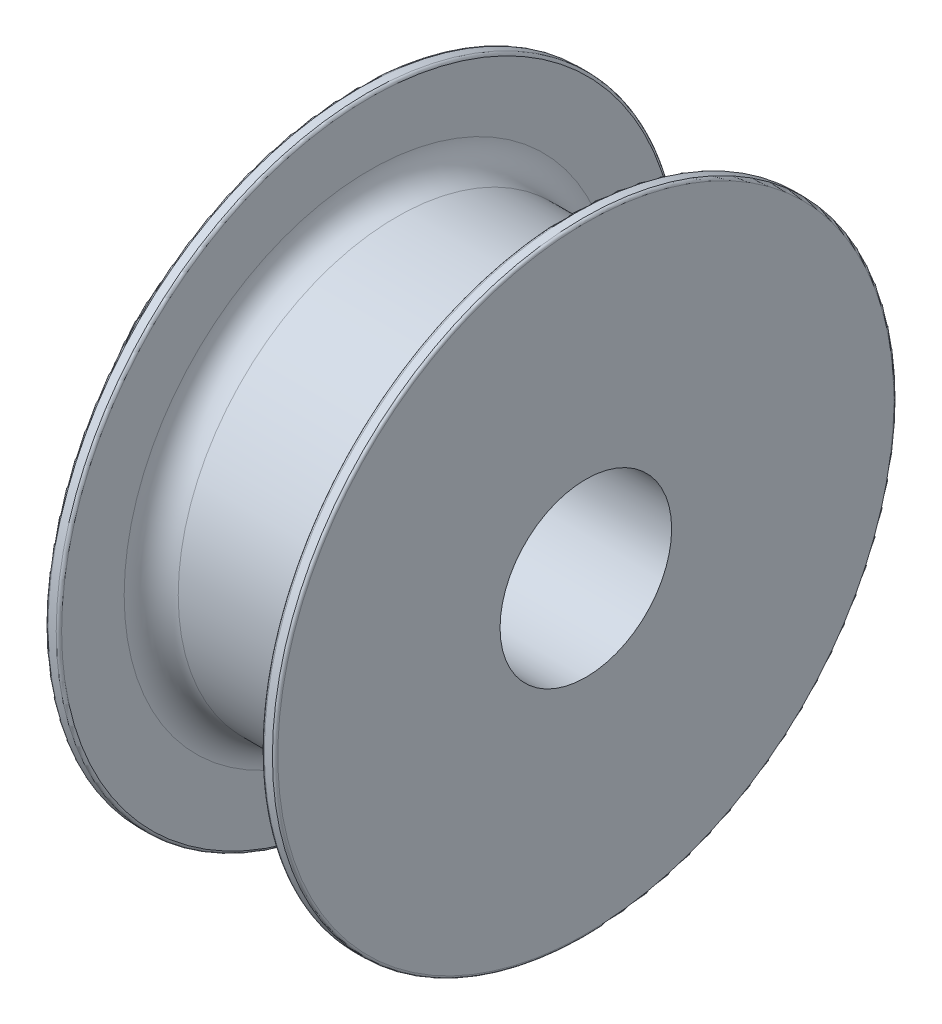
ISO-10303-21;
HEADER;
FILE_DESCRIPTION(('STEP AP214'),'2;1');
FILE_NAME('part.step','',(''),(''),'','','');
FILE_SCHEMA(('AUTOMOTIVE_DESIGN { 1 0 10303 214 1 1 1 1 }'));
ENDSEC;
DATA;
#1=APPLICATION_CONTEXT('core data for automotive mechanical design processes');
#2=APPLICATION_PROTOCOL_DEFINITION('international standard','automotive_design',2000,#1);
#3=PRODUCT_CONTEXT('',#1,'mechanical');
#4=PRODUCT('Part','Part','',(#3));
#5=PRODUCT_RELATED_PRODUCT_CATEGORY('part','',(#4));
#6=PRODUCT_DEFINITION_FORMATION('','',#4);
#7=PRODUCT_DEFINITION_CONTEXT('part definition',#1,'design');
#8=PRODUCT_DEFINITION('design','',#6,#7);
#9=PRODUCT_DEFINITION_SHAPE('','',#8);
#10=(LENGTH_UNIT() NAMED_UNIT(*) SI_UNIT(.MILLI.,.METRE.));
#11=(NAMED_UNIT(*) PLANE_ANGLE_UNIT() SI_UNIT($,.RADIAN.));
#12=(NAMED_UNIT(*) SI_UNIT($,.STERADIAN.) SOLID_ANGLE_UNIT());
#13=UNCERTAINTY_MEASURE_WITH_UNIT(LENGTH_MEASURE(1.E-05),#10,'distance_accuracy_value','');
#14=(GEOMETRIC_REPRESENTATION_CONTEXT(3) GLOBAL_UNCERTAINTY_ASSIGNED_CONTEXT((#13)) GLOBAL_UNIT_ASSIGNED_CONTEXT((#10,
#11,#12)) REPRESENTATION_CONTEXT('',''));
#15=CARTESIAN_POINT('',(0.,0.,0.));
#16=DIRECTION('',(0.,0.,1.));
#17=DIRECTION('',(1.,0.,0.));
#18=AXIS2_PLACEMENT_3D('',#15,#16,#17);
#19=CARTESIAN_POINT('',(-1.,0.,0.));
#20=DIRECTION('',(-1.,0.,0.));
#21=DIRECTION('',(0.,0.,1.));
#22=AXIS2_PLACEMENT_3D('',#19,#20,#21);
#23=PLANE('',#22);
#24=CARTESIAN_POINT('',(-1.,0.,0.));
#25=DIRECTION('',(-1.,0.,0.));
#26=DIRECTION('',(0.,0.,1.));
#27=AXIS2_PLACEMENT_3D('',#24,#25,#26);
#28=CIRCLE('',#27,22.8);
#29=CARTESIAN_POINT('',(-1.,0.,22.8));
#30=VERTEX_POINT('',#29);
#31=EDGE_CURVE('E158',#30,#30,#28,.T.);
#32=ORIENTED_EDGE('',*,*,#31,.T.);
#33=EDGE_LOOP('',(#32));
#34=FACE_BOUND('',#33,.T.);
#35=CARTESIAN_POINT('',(-1.,0.,0.));
#36=DIRECTION('',(-1.,0.,0.));
#37=DIRECTION('',(0.,0.,1.));
#38=AXIS2_PLACEMENT_3D('',#35,#36,#37);
#39=CIRCLE('',#38,12.5);
#40=CARTESIAN_POINT('',(-1.,0.,12.5));
#41=VERTEX_POINT('',#40);
#42=EDGE_CURVE('E179',#41,#41,#39,.T.);
#43=ORIENTED_EDGE('',*,*,#42,.F.);
#44=EDGE_LOOP('',(#43));
#45=FACE_BOUND('',#44,.T.);
#46=ADVANCED_FACE('F31',(#34,#45),#23,.T.);
#47=CARTESIAN_POINT('',(15.,0.,0.));
#48=DIRECTION('',(-1.,0.,0.));
#49=DIRECTION('',(0.,0.,1.));
#50=AXIS2_PLACEMENT_3D('',#47,#48,#49);
#51=CYLINDRICAL_SURFACE('',#50,16.1701558764829);
#52=CARTESIAN_POINT('',(2.,0.,0.));
#53=DIRECTION('',(-1.,0.,0.));
#54=DIRECTION('',(0.,0.,1.));
#55=AXIS2_PLACEMENT_3D('',#52,#53,#54);
#56=CIRCLE('',#55,16.1701558764829);
#57=CARTESIAN_POINT('',(2.,0.,16.1701558764829));
#58=VERTEX_POINT('',#57);
#59=EDGE_CURVE('E143',#58,#58,#56,.F.);
#60=ORIENTED_EDGE('',*,*,#59,.T.);
#61=EDGE_LOOP('',(#60));
#62=FACE_BOUND('',#61,.T.);
#63=CARTESIAN_POINT('',(13.,0.,0.));
#64=DIRECTION('',(1.,0.,0.));
#65=DIRECTION('',(0.,0.,-1.));
#66=AXIS2_PLACEMENT_3D('',#63,#64,#65);
#67=CIRCLE('',#66,16.1701558764829);
#68=CARTESIAN_POINT('',(13.,0.,-16.1701558764829));
#69=VERTEX_POINT('',#68);
#70=EDGE_CURVE('E149',#69,#69,#67,.F.);
#71=ORIENTED_EDGE('',*,*,#70,.T.);
#72=EDGE_LOOP('',(#71));
#73=FACE_BOUND('',#72,.T.);
#74=ADVANCED_FACE('F81',(#62,#73),#51,.T.);
#75=CARTESIAN_POINT('',(15.,0.,0.));
#76=DIRECTION('',(-1.,0.,0.));
#77=DIRECTION('',(0.,0.,1.));
#78=AXIS2_PLACEMENT_3D('',#75,#76,#77);
#79=CYLINDRICAL_SURFACE('',#78,6.35);
#80=CARTESIAN_POINT('',(-1.25733825878287,0.,-6.35));
#81=CARTESIAN_POINT('',(-1.2573391465005,0.0834969220594999,-6.34999931166444));
#82=CARTESIAN_POINT('',(-1.26063813322883,0.167002655580042,-6.34834758911701));
#83=CARTESIAN_POINT('',(-1.27378413333277,0.333378330258781,-6.34179105821715));
#84=CARTESIAN_POINT('',(-1.28363399530864,0.416247978955771,-6.33688483467113));
#85=CARTESIAN_POINT('',(-1.32291032382889,0.66318203064701,-6.31742426748325));
#86=CARTESIAN_POINT('',(-1.36206333618427,0.825450146761554,-6.29812827299425));
#87=CARTESIAN_POINT('',(-1.46432897007702,1.13965128900426,-6.2489182313574));
#88=CARTESIAN_POINT('',(-1.52734847802628,1.29162180811869,-6.21904547786825));
#89=CARTESIAN_POINT('',(-1.67507433241177,1.58264035037879,-6.15142812041637));
#90=CARTESIAN_POINT('',(-1.75977896893383,1.72168939123018,-6.11368413715877));
#91=CARTESIAN_POINT('',(-1.95430788851709,1.99234108848171,-6.03111096182982));
#92=CARTESIAN_POINT('',(-2.0653418365768,2.12298433900091,-5.98599127270818));
#93=CARTESIAN_POINT('',(-2.30673494235566,2.36467069069853,-5.89470535591056));
#94=CARTESIAN_POINT('',(-2.43710868854931,2.47569885601321,-5.84853836069043));
#95=CARTESIAN_POINT('',(-2.72575920653619,2.68368848497886,-5.75623634934464));
#96=CARTESIAN_POINT('',(-2.88541579008446,2.77889135161934,-5.71038146176788));
#97=CARTESIAN_POINT('',(-3.1368862459573,2.90019349951534,-5.64919759286363));
#98=CARTESIAN_POINT('',(-3.22273832061155,2.93705266116892,-5.63006420805933));
#99=CARTESIAN_POINT('',(-3.39792387248929,3.00322508739606,-5.59504604853267));
#100=CARTESIAN_POINT('',(-3.48725525696343,3.03254280972159,-5.57915935583429));
#101=CARTESIAN_POINT('',(-3.66334881074762,3.08174263292982,-5.55212611635049));
#102=CARTESIAN_POINT('',(-3.74994905281144,3.10208128111978,-5.54075429137746));
#103=CARTESIAN_POINT('',(-3.92492553777727,3.13545600360765,-5.52193654886444));
#104=CARTESIAN_POINT('',(-4.01330081255457,3.14849595237257,-5.51448854851135));
#105=CARTESIAN_POINT('',(-4.19104499763149,3.1670771305344,-5.50383875782919));
#106=CARTESIAN_POINT('',(-4.28041327677027,3.1726228759965,-5.50063441026522));
#107=CARTESIAN_POINT('',(-4.45931904296096,3.17614778806993,-5.49859788398609));
#108=CARTESIAN_POINT('',(-4.54885651305421,3.17412767659872,-5.49976528812799));
#109=CARTESIAN_POINT('',(-4.79508613450728,3.1581193033026,-5.50899190362732));
#110=CARTESIAN_POINT('',(-4.95117998859624,3.13621253452965,-5.52160857357707));
#111=CARTESIAN_POINT('',(-5.2569849000894,3.07003746372168,-5.55866493052824));
#112=CARTESIAN_POINT('',(-5.40669390780564,3.02576203854504,-5.58310838358077));
#113=CARTESIAN_POINT('',(-5.69988255534701,2.91531509833647,-5.64157885407236));
#114=CARTESIAN_POINT('',(-5.8431358687195,2.84865758129418,-5.67581583876129));
#115=CARTESIAN_POINT('',(-6.11710434495689,2.69570761526054,-5.75003268807633));
#116=CARTESIAN_POINT('',(-6.24781383839138,2.60940634674629,-5.79001512927804));
#117=CARTESIAN_POINT('',(-6.51044253303317,2.40685964249565,-5.87734289018611));
#118=CARTESIAN_POINT('',(-6.64041364363938,2.28820488335253,-5.92497898403936));
#119=CARTESIAN_POINT('',(-6.87942340164671,2.03058898448427,-6.01813700574905));
#120=CARTESIAN_POINT('',(-6.98845204514157,1.89161819563546,-6.06365791538158));
#121=CARTESIAN_POINT('',(-7.18724017850259,1.58913989972483,-6.1500381059768));
#122=CARTESIAN_POINT('',(-7.27586974436281,1.42479265164789,-6.19058274974572));
#123=CARTESIAN_POINT('',(-7.42349634041822,1.08098023585583,-6.25976272299952));
#124=CARTESIAN_POINT('',(-7.48251689991458,0.901527205073897,-6.28840750578946));
#125=CARTESIAN_POINT('',(-7.56439766218192,0.548533610626834,-6.32854759690358));
#126=CARTESIAN_POINT('',(-7.58984793137021,0.375734359385245,-6.34126679122995));
#127=CARTESIAN_POINT('',(-7.61198878104313,0.0278752299448318,-6.35231817716325));
#128=CARTESIAN_POINT('',(-7.6086929859222,-0.147183538060018,-6.35065718436129));
#129=CARTESIAN_POINT('',(-7.57493202283749,-0.480164686080361,-6.33384535408399));
#130=CARTESIAN_POINT('',(-7.54659246730803,-0.638363620564189,-6.31975005060431));
#131=CARTESIAN_POINT('',(-7.46688238057298,-0.947441883053,-6.28085393924121));
#132=CARTESIAN_POINT('',(-7.41550931030559,-1.09832040207141,-6.25605195113515));
#133=CARTESIAN_POINT('',(-7.28984312784507,-1.39347133182512,-6.19709998236334));
#134=CARTESIAN_POINT('',(-7.21493667467168,-1.53743151047822,-6.16270299610717));
#135=CARTESIAN_POINT('',(-7.045021833097,-1.8112148234104,-6.08787118465664));
#136=CARTESIAN_POINT('',(-6.95000488139747,-1.94103189959927,-6.0474337895468));
#137=CARTESIAN_POINT('',(-6.7317989084091,-2.19636241342679,-5.95973602709939));
#138=CARTESIAN_POINT('',(-6.60675965167131,-2.3202013468198,-5.91219559251098));
#139=CARTESIAN_POINT('',(-6.33757590363312,-2.54589381918874,-5.81858093231368));
#140=CARTESIAN_POINT('',(-6.19341830640194,-2.6477321493525,-5.77250773963547));
#141=CARTESIAN_POINT('',(-5.88126965682452,-2.83117262876716,-5.68487535288742));
#142=CARTESIAN_POINT('',(-5.71246248927249,-2.91155594998014,-5.64364281441821));
#143=CARTESIAN_POINT('',(-5.3609937938932,-3.04191297152938,-5.5744767953732));
#144=CARTESIAN_POINT('',(-5.17835046093549,-3.0919258549222,-5.54652618900869));
#145=CARTESIAN_POINT('',(-4.82314830231271,-3.15551086037918,-5.51057765714603));
#146=CARTESIAN_POINT('',(-4.65130450837566,-3.17212027309711,-5.50092192343245));
#147=CARTESIAN_POINT('',(-4.30709381628767,-3.17718805563876,-5.49800001145358));
#148=CARTESIAN_POINT('',(-4.13472717724023,-3.16565862768386,-5.5047267290444));
#149=CARTESIAN_POINT('',(-3.81167815570896,-3.11761548073658,-5.53205211477784));
#150=CARTESIAN_POINT('',(-3.66049431705172,-3.08358651207686,-5.55126823076269));
#151=CARTESIAN_POINT('',(-3.3661474286157,-2.99458164828807,-5.59977978302582));
#152=CARTESIAN_POINT('',(-3.22298697593257,-2.93959901505999,-5.62907846127335));
#153=CARTESIAN_POINT('',(-2.93810455935433,-2.8061154442137,-5.69685576337174));
#154=CARTESIAN_POINT('',(-2.7971254494172,-2.72628260503929,-5.73581889480533));
#155=CARTESIAN_POINT('',(-2.52964082705977,-2.54682759156583,-5.81772207082382));
#156=CARTESIAN_POINT('',(-2.40314289884016,-2.44719512169931,-5.8606641782013));
#157=CARTESIAN_POINT('',(-2.15224073460581,-2.21680287661219,-5.95192753761203));
#158=CARTESIAN_POINT('',(-2.02995850237008,-2.08373188558712,-6.00026839877346));
#159=CARTESIAN_POINT('',(-1.80894038554976,-1.79751265125244,-6.0921234557675));
#160=CARTESIAN_POINT('',(-1.71021719280015,-1.64435365457428,-6.13563504323042));
#161=CARTESIAN_POINT('',(-1.5820579925858,-1.40178715704487,-6.19391073190243));
#162=CARTESIAN_POINT('',(-1.54253767510148,-1.31842200030919,-6.21223173271383));
#163=CARTESIAN_POINT('',(-1.47073878395917,-1.1480770102167,-6.24595363475604));
#164=CARTESIAN_POINT('',(-1.4384566522485,-1.06109897786306,-6.26135597012704));
#165=CARTESIAN_POINT('',(-1.38157891286787,-0.884361322813108,-6.28875097111981));
#166=CARTESIAN_POINT('',(-1.35696654064476,-0.794608244970572,-6.30075106809478));
#167=CARTESIAN_POINT('',(-1.31567086925298,-0.612925661591582,-6.32100983571903));
#168=CARTESIAN_POINT('',(-1.29898272658933,-0.520997521680291,-6.3292707916836));
#169=CARTESIAN_POINT('',(-1.27672197392048,-0.357531347524375,-6.34032503263334));
#170=CARTESIAN_POINT('',(-1.26945943753324,-0.286274046488597,-6.34394670812889));
#171=CARTESIAN_POINT('',(-1.2597671322453,-0.143346668941348,-6.34878452045567));
#172=CARTESIAN_POINT('',(-1.25733749673604,-0.0716765810914262,-6.35000059089052));
#173=CARTESIAN_POINT('',(-1.25733825878287,0.,-6.35));
#174=B_SPLINE_CURVE_WITH_KNOTS('',3,(#80,#81,#82,#83,#84,#85,#86,#87,#88,#89,#90,#91,#92,#93,
#94,#95,#96,#97,#98,#99,#100,#101,#102,#103,#104,#105,#106,#107,#108,#109,#110,#111,#112,#113,
#114,#115,#116,#117,#118,#119,#120,#121,#122,#123,#124,#125,#126,#127,#128,#129,#130,#131,#132,
#133,#134,#135,#136,#137,#138,#139,#140,#141,#142,#143,#144,#145,#146,#147,#148,#149,#150,#151,
#152,#153,#154,#155,#156,#157,#158,#159,#160,#161,#162,#163,#164,#165,#166,#167,#168,#169,#170,
#171,#172,#173),.UNSPECIFIED.,.T.,.F.,(4,2,2,2,2,2,2,2,2,2,2,2,2,2,2,2,2,2,2,2,2,2,2,2,2,2,2,2,
2,2,2,2,2,2,2,2,2,2,2,2,2,2,2,2,2,2,4),(0.,0.25041561210268,0.500940186864014,1.00234854488129,
1.50182051324263,2.00125310940106,2.53090025348452,3.06094897410615,3.63210298373098,
3.91787290005989,4.20347350732849,4.47213270490103,4.74064915090148,5.00900371453887,
5.27733267302576,5.74927594687739,6.22136960256846,6.70445970327764,7.18776712794021,
7.73235646527881,8.27720530143646,8.84735553323666,9.41705196489304,9.93956405039339,
10.4618285011675,10.9436138594975,11.4254523397102,11.9210677568139,12.4168946391879,
12.9614122158798,13.5063050164601,14.0775857365549,14.6481278321882,15.1639000911419,
15.6794487286237,16.1458838633213,16.6124691169503,17.1104020806943,17.6085946442304,
18.1673210354482,18.7263477502426,19.0082017078365,19.2899168101042,19.5710117490933,
19.8519346536844,20.0668939492148,20.2818591776892),.UNSPECIFIED.);
#175=CARTESIAN_POINT('',(-1.25733825878287,0.,-6.35));
#176=VERTEX_POINT('',#175);
#177=EDGE_CURVE('E55',#176,#176,#174,.T.);
#178=ORIENTED_EDGE('',*,*,#177,.F.);
#179=EDGE_LOOP('',(#178));
#180=FACE_BOUND('',#179,.T.);
#181=CARTESIAN_POINT('',(16.,0.,0.));
#182=DIRECTION('',(1.,0.,0.));
#183=DIRECTION('',(0.,0.,-1.));
#184=AXIS2_PLACEMENT_3D('',#181,#182,#183);
#185=CIRCLE('',#184,6.35);
#186=CARTESIAN_POINT('',(16.,0.,-6.35));
#187=VERTEX_POINT('',#186);
#188=EDGE_CURVE('E175',#187,#187,#185,.T.);
#189=ORIENTED_EDGE('',*,*,#188,.T.);
#190=EDGE_LOOP('',(#189));
#191=FACE_BOUND('',#190,.T.);
#192=CARTESIAN_POINT('',(-8.5,0.,0.));
#193=DIRECTION('',(-1.,0.,0.));
#194=DIRECTION('',(0.,0.,1.));
#195=AXIS2_PLACEMENT_3D('',#192,#193,#194);
#196=CIRCLE('',#195,6.35);
#197=CARTESIAN_POINT('',(-8.5,0.,6.35));
#198=VERTEX_POINT('',#197);
#199=EDGE_CURVE('E73',#198,#198,#196,.T.);
#200=ORIENTED_EDGE('',*,*,#199,.T.);
#201=EDGE_LOOP('',(#200));
#202=FACE_BOUND('',#201,.T.);
#203=ADVANCED_FACE('F75',(#180,#191,#202),#79,.F.);
#204=CARTESIAN_POINT('',(15.,0.,0.));
#205=DIRECTION('',(1.,0.,0.));
#206=DIRECTION('',(0.,0.,-1.));
#207=AXIS2_PLACEMENT_3D('',#204,#205,#206);
#208=PLANE('',#207);
#209=CARTESIAN_POINT('',(15.,0.,0.));
#210=DIRECTION('',(1.,0.,0.));
#211=DIRECTION('',(0.,0.,-1.));
#212=AXIS2_PLACEMENT_3D('',#209,#210,#211);
#213=CIRCLE('',#212,22.8);
#214=CARTESIAN_POINT('',(15.,0.,-22.8));
#215=VERTEX_POINT('',#214);
#216=EDGE_CURVE('E42',#215,#215,#213,.F.);
#217=ORIENTED_EDGE('',*,*,#216,.T.);
#218=EDGE_LOOP('',(#217));
#219=FACE_BOUND('',#218,.T.);
#220=CARTESIAN_POINT('',(15.,0.,0.));
#221=DIRECTION('',(1.,0.,0.));
#222=DIRECTION('',(0.,0.,-1.));
#223=AXIS2_PLACEMENT_3D('',#220,#221,#222);
#224=CIRCLE('',#223,18.1701558764829);
#225=CARTESIAN_POINT('',(15.,0.,-18.1701558764829));
#226=VERTEX_POINT('',#225);
#227=EDGE_CURVE('E140',#226,#226,#224,.T.);
#228=ORIENTED_EDGE('',*,*,#227,.T.);
#229=EDGE_LOOP('',(#228));
#230=FACE_BOUND('',#229,.T.);
#231=ADVANCED_FACE('F80',(#219,#230),#208,.F.);
#232=CARTESIAN_POINT('',(16.,0.,0.));
#233=DIRECTION('',(1.,0.,0.));
#234=DIRECTION('',(0.,0.,-1.));
#235=AXIS2_PLACEMENT_3D('',#232,#233,#234);
#236=PLANE('',#235);
#237=CARTESIAN_POINT('',(16.,0.,0.));
#238=DIRECTION('',(1.,0.,0.));
#239=DIRECTION('',(0.,0.,-1.));
#240=AXIS2_PLACEMENT_3D('',#237,#238,#239);
#241=CIRCLE('',#240,22.8);
#242=CARTESIAN_POINT('',(16.,0.,-22.8));
#243=VERTEX_POINT('',#242);
#244=EDGE_CURVE('E142',#243,#243,#241,.T.);
#245=ORIENTED_EDGE('',*,*,#244,.T.);
#246=EDGE_LOOP('',(#245));
#247=FACE_BOUND('',#246,.T.);
#248=ORIENTED_EDGE('',*,*,#188,.F.);
#249=EDGE_LOOP('',(#248));
#250=FACE_BOUND('',#249,.T.);
#251=ADVANCED_FACE('F130',(#247,#250),#236,.T.);
#252=CARTESIAN_POINT('',(16.,0.,0.));
#253=DIRECTION('',(-1.,0.,0.));
#254=DIRECTION('',(0.,0.,1.));
#255=AXIS2_PLACEMENT_3D('',#252,#253,#254);
#256=CYLINDRICAL_SURFACE('',#255,23.);
#257=CARTESIAN_POINT('',(15.8,0.,0.));
#258=DIRECTION('',(1.,0.,0.));
#259=DIRECTION('',(0.,0.,-1.));
#260=AXIS2_PLACEMENT_3D('',#257,#258,#259);
#261=CIRCLE('',#260,23.);
#262=CARTESIAN_POINT('',(15.8,0.,-23.));
#263=VERTEX_POINT('',#262);
#264=EDGE_CURVE('E155',#263,#263,#261,.F.);
#265=ORIENTED_EDGE('',*,*,#264,.T.);
#266=EDGE_LOOP('',(#265));
#267=FACE_BOUND('',#266,.T.);
#268=CARTESIAN_POINT('',(15.2,0.,0.));
#269=DIRECTION('',(1.,0.,0.));
#270=DIRECTION('',(0.,0.,-1.));
#271=AXIS2_PLACEMENT_3D('',#268,#269,#270);
#272=CIRCLE('',#271,23.);
#273=CARTESIAN_POINT('',(15.2,0.,-23.));
#274=VERTEX_POINT('',#273);
#275=EDGE_CURVE('E146',#274,#274,#272,.T.);
#276=ORIENTED_EDGE('',*,*,#275,.T.);
#277=EDGE_LOOP('',(#276));
#278=FACE_BOUND('',#277,.T.);
#279=ADVANCED_FACE('F83',(#267,#278),#256,.T.);
#280=CARTESIAN_POINT('',(0.,0.,0.));
#281=DIRECTION('',(-1.,0.,0.));
#282=DIRECTION('',(0.,0.,1.));
#283=AXIS2_PLACEMENT_3D('',#280,#281,#282);
#284=PLANE('',#283);
#285=CARTESIAN_POINT('',(0.,0.,0.));
#286=DIRECTION('',(-1.,0.,0.));
#287=DIRECTION('',(0.,0.,1.));
#288=AXIS2_PLACEMENT_3D('',#285,#286,#287);
#289=CIRCLE('',#288,22.8);
#290=CARTESIAN_POINT('',(0.,0.,22.8));
#291=VERTEX_POINT('',#290);
#292=EDGE_CURVE('E46',#291,#291,#289,.F.);
#293=ORIENTED_EDGE('',*,*,#292,.T.);
#294=EDGE_LOOP('',(#293));
#295=FACE_BOUND('',#294,.T.);
#296=CARTESIAN_POINT('',(0.,0.,0.));
#297=DIRECTION('',(-1.,0.,0.));
#298=DIRECTION('',(0.,0.,1.));
#299=AXIS2_PLACEMENT_3D('',#296,#297,#298);
#300=CIRCLE('',#299,18.1701558764829);
#301=CARTESIAN_POINT('',(0.,0.,18.1701558764829));
#302=VERTEX_POINT('',#301);
#303=EDGE_CURVE('E173',#302,#302,#300,.T.);
#304=ORIENTED_EDGE('',*,*,#303,.T.);
#305=EDGE_LOOP('',(#304));
#306=FACE_BOUND('',#305,.T.);
#307=ADVANCED_FACE('F123',(#295,#306),#284,.F.);
#308=CARTESIAN_POINT('',(-1.,0.,0.));
#309=DIRECTION('',(1.,0.,0.));
#310=DIRECTION('',(0.,0.,-1.));
#311=AXIS2_PLACEMENT_3D('',#308,#309,#310);
#312=CYLINDRICAL_SURFACE('',#311,23.);
#313=CARTESIAN_POINT('',(-0.8,0.,0.));
#314=DIRECTION('',(-1.,0.,0.));
#315=DIRECTION('',(0.,0.,1.));
#316=AXIS2_PLACEMENT_3D('',#313,#314,#315);
#317=CIRCLE('',#316,23.);
#318=CARTESIAN_POINT('',(-0.8,0.,23.));
#319=VERTEX_POINT('',#318);
#320=EDGE_CURVE('E163',#319,#319,#317,.F.);
#321=ORIENTED_EDGE('',*,*,#320,.T.);
#322=EDGE_LOOP('',(#321));
#323=FACE_BOUND('',#322,.T.);
#324=CARTESIAN_POINT('',(-0.2,0.,0.));
#325=DIRECTION('',(-1.,0.,0.));
#326=DIRECTION('',(0.,0.,1.));
#327=AXIS2_PLACEMENT_3D('',#324,#325,#326);
#328=CIRCLE('',#327,23.);
#329=CARTESIAN_POINT('',(-0.2,0.,23.));
#330=VERTEX_POINT('',#329);
#331=EDGE_CURVE('E160',#330,#330,#328,.T.);
#332=ORIENTED_EDGE('',*,*,#331,.T.);
#333=EDGE_LOOP('',(#332));
#334=FACE_BOUND('',#333,.T.);
#335=ADVANCED_FACE('F92',(#323,#334),#312,.T.);
#336=CARTESIAN_POINT('',(2.,0.,0.));
#337=DIRECTION('',(-1.,0.,0.));
#338=DIRECTION('',(0.,0.,1.));
#339=AXIS2_PLACEMENT_3D('',#336,#337,#338);
#340=TOROIDAL_SURFACE('',#339,18.1701558764829,2.);
#341=ORIENTED_EDGE('',*,*,#59,.F.);
#342=EDGE_LOOP('',(#341));
#343=FACE_BOUND('',#342,.T.);
#344=ORIENTED_EDGE('',*,*,#303,.F.);
#345=EDGE_LOOP('',(#344));
#346=FACE_BOUND('',#345,.T.);
#347=ADVANCED_FACE('F88',(#343,#346),#340,.F.);
#348=CARTESIAN_POINT('',(13.,0.,0.));
#349=DIRECTION('',(1.,0.,0.));
#350=DIRECTION('',(0.,0.,-1.));
#351=AXIS2_PLACEMENT_3D('',#348,#349,#350);
#352=TOROIDAL_SURFACE('',#351,18.1701558764829,2.);
#353=ORIENTED_EDGE('',*,*,#70,.F.);
#354=EDGE_LOOP('',(#353));
#355=FACE_BOUND('',#354,.T.);
#356=ORIENTED_EDGE('',*,*,#227,.F.);
#357=EDGE_LOOP('',(#356));
#358=FACE_BOUND('',#357,.T.);
#359=ADVANCED_FACE('F91',(#355,#358),#352,.F.);
#360=CARTESIAN_POINT('',(15.8,0.,0.));
#361=DIRECTION('',(1.,0.,0.));
#362=DIRECTION('',(0.,0.,-1.));
#363=AXIS2_PLACEMENT_3D('',#360,#361,#362);
#364=TOROIDAL_SURFACE('',#363,22.8,0.2);
#365=ORIENTED_EDGE('',*,*,#264,.F.);
#366=EDGE_LOOP('',(#365));
#367=FACE_BOUND('',#366,.T.);
#368=ORIENTED_EDGE('',*,*,#244,.F.);
#369=EDGE_LOOP('',(#368));
#370=FACE_BOUND('',#369,.T.);
#371=ADVANCED_FACE('F96',(#367,#370),#364,.T.);
#372=CARTESIAN_POINT('',(-0.8,0.,0.));
#373=DIRECTION('',(-1.,0.,0.));
#374=DIRECTION('',(0.,0.,1.));
#375=AXIS2_PLACEMENT_3D('',#372,#373,#374);
#376=TOROIDAL_SURFACE('',#375,22.8,0.2);
#377=ORIENTED_EDGE('',*,*,#320,.F.);
#378=EDGE_LOOP('',(#377));
#379=FACE_BOUND('',#378,.T.);
#380=ORIENTED_EDGE('',*,*,#31,.F.);
#381=EDGE_LOOP('',(#380));
#382=FACE_BOUND('',#381,.T.);
#383=ADVANCED_FACE('F100',(#379,#382),#376,.T.);
#384=CARTESIAN_POINT('',(-0.2,0.,0.));
#385=DIRECTION('',(-1.,0.,0.));
#386=DIRECTION('',(0.,0.,1.));
#387=AXIS2_PLACEMENT_3D('',#384,#385,#386);
#388=TOROIDAL_SURFACE('',#387,22.8,0.2);
#389=ORIENTED_EDGE('',*,*,#292,.F.);
#390=EDGE_LOOP('',(#389));
#391=FACE_BOUND('',#390,.T.);
#392=ORIENTED_EDGE('',*,*,#331,.F.);
#393=EDGE_LOOP('',(#392));
#394=FACE_BOUND('',#393,.T.);
#395=ADVANCED_FACE('F104',(#391,#394),#388,.T.);
#396=CARTESIAN_POINT('',(15.2,0.,0.));
#397=DIRECTION('',(1.,0.,0.));
#398=DIRECTION('',(0.,0.,-1.));
#399=AXIS2_PLACEMENT_3D('',#396,#397,#398);
#400=TOROIDAL_SURFACE('',#399,22.8,0.2);
#401=ORIENTED_EDGE('',*,*,#216,.F.);
#402=EDGE_LOOP('',(#401));
#403=FACE_BOUND('',#402,.T.);
#404=ORIENTED_EDGE('',*,*,#275,.F.);
#405=EDGE_LOOP('',(#404));
#406=FACE_BOUND('',#405,.T.);
#407=ADVANCED_FACE('F107',(#403,#406),#400,.T.);
#408=CARTESIAN_POINT('',(-8.5,0.,0.));
#409=DIRECTION('',(-1.,0.,0.));
#410=DIRECTION('',(0.,0.,1.));
#411=AXIS2_PLACEMENT_3D('',#408,#409,#410);
#412=PLANE('',#411);
#413=CARTESIAN_POINT('',(-8.5,0.,0.));
#414=DIRECTION('',(-1.,0.,0.));
#415=DIRECTION('',(0.,0.,1.));
#416=AXIS2_PLACEMENT_3D('',#413,#414,#415);
#417=CIRCLE('',#416,12.3);
#418=CARTESIAN_POINT('',(-8.5,0.,12.3));
#419=VERTEX_POINT('',#418);
#420=EDGE_CURVE('E38',#419,#419,#417,.T.);
#421=ORIENTED_EDGE('',*,*,#420,.T.);
#422=EDGE_LOOP('',(#421));
#423=FACE_BOUND('',#422,.T.);
#424=ORIENTED_EDGE('',*,*,#199,.F.);
#425=EDGE_LOOP('',(#424));
#426=FACE_BOUND('',#425,.T.);
#427=ADVANCED_FACE('F65',(#423,#426),#412,.T.);
#428=CARTESIAN_POINT('',(-8.5,0.,0.));
#429=DIRECTION('',(1.,0.,0.));
#430=DIRECTION('',(0.,0.,-1.));
#431=AXIS2_PLACEMENT_3D('',#428,#429,#430);
#432=CYLINDRICAL_SURFACE('',#431,12.5);
#433=CARTESIAN_POINT('',(-8.3,0.,0.));
#434=DIRECTION('',(-1.,0.,0.));
#435=DIRECTION('',(0.,0.,1.));
#436=AXIS2_PLACEMENT_3D('',#433,#434,#435);
#437=CIRCLE('',#436,12.5);
#438=CARTESIAN_POINT('',(-8.3,0.,12.5));
#439=VERTEX_POINT('',#438);
#440=EDGE_CURVE('E10',#439,#439,#437,.F.);
#441=ORIENTED_EDGE('',*,*,#440,.T.);
#442=EDGE_LOOP('',(#441));
#443=FACE_BOUND('',#442,.T.);
#444=CARTESIAN_POINT('',(-7.60733825878287,0.,-12.5));
#445=CARTESIAN_POINT('',(-7.60733350714086,-0.175329078832713,-12.4999970999242));
#446=CARTESIAN_POINT('',(-7.59276647016395,-0.350710704982818,-12.4962745188004));
#447=CARTESIAN_POINT('',(-7.5349741859318,-0.696441446871011,-12.4817853024434));
#448=CARTESIAN_POINT('',(-7.49173327262876,-0.866787758377897,-12.4710148166113));
#449=CARTESIAN_POINT('',(-7.3780748015993,-1.19740579662698,-12.4436215437245));
#450=CARTESIAN_POINT('',(-7.30769044758771,-1.35768955510094,-12.427005909028));
#451=CARTESIAN_POINT('',(-7.14186134711602,-1.66417545509294,-12.3896887110145));
#452=CARTESIAN_POINT('',(-7.04641555867269,-1.81037701076746,-12.368986977818));
#453=CARTESIAN_POINT('',(-6.83103516782017,-2.08764885339807,-12.3252512632257));
#454=CARTESIAN_POINT('',(-6.7106688188446,-2.21837795966611,-12.3021803746745));
#455=CARTESIAN_POINT('',(-6.44978809668657,-2.4580277940745,-12.2565498295025));
#456=CARTESIAN_POINT('',(-6.30927137962711,-2.56694598164683,-12.2339902327088));
#457=CARTESIAN_POINT('',(-6.00941215563928,-2.76150057438904,-12.1915632029738));
#458=CARTESIAN_POINT('',(-5.84981315077795,-2.84675278228631,-12.171742557565));
#459=CARTESIAN_POINT('',(-5.51796374126705,-2.98908379183859,-12.1375768800601));
#460=CARTESIAN_POINT('',(-5.34571543661414,-3.04616725788606,-12.12323094151));
#461=CARTESIAN_POINT('',(-4.99721495470735,-3.12937154373996,-12.1020187073583));
#462=CARTESIAN_POINT('',(-4.82111876470116,-3.15610703179977,-12.0950041633357));
#463=CARTESIAN_POINT('',(-4.46681167834915,-3.1797714485858,-12.0888053768844));
#464=CARTESIAN_POINT('',(-4.28860114292939,-3.17670539345195,-12.0896198166957));
#465=CARTESIAN_POINT('',(-3.93985518050882,-3.14134360280128,-12.0988538474305));
#466=CARTESIAN_POINT('',(-3.76923936025537,-3.10978294361414,-12.1070821713438));
#467=CARTESIAN_POINT('',(-3.43580719424669,-3.01950154861595,-12.1299116949129));
#468=CARTESIAN_POINT('',(-3.27299142103623,-2.96077882239565,-12.1445133615965));
#469=CARTESIAN_POINT('',(-2.95782294753955,-2.81722026717664,-12.1786181493478));
#470=CARTESIAN_POINT('',(-2.80559634769283,-2.73211979887868,-12.1981705580715));
#471=CARTESIAN_POINT('',(-2.51732165421351,-2.53840641971092,-12.2399462552069));
#472=CARTESIAN_POINT('',(-2.3812764822172,-2.42978927274375,-12.2621700244939));
#473=CARTESIAN_POINT('',(-2.12501694694716,-2.18832967808127,-12.3075875672896));
#474=CARTESIAN_POINT('',(-2.00538730167762,-2.05486761919694,-12.3307906254556));
#475=CARTESIAN_POINT('',(-1.79009424909864,-1.76949669251485,-12.3749625024009));
#476=CARTESIAN_POINT('',(-1.69443162110063,-1.61758722511965,-12.3959312485167));
#477=CARTESIAN_POINT('',(-1.52956346893854,-1.29878267520359,-12.4333818047896));
#478=CARTESIAN_POINT('',(-1.46045545866484,-1.13183508715489,-12.44984701449));
#479=CARTESIAN_POINT('',(-1.35144961659046,-0.788179983917568,-12.4763147869053));
#480=CARTESIAN_POINT('',(-1.31154601160151,-0.61147440514093,-12.4863186268713));
#481=CARTESIAN_POINT('',(-1.26298055815666,-0.25831643036689,-12.4985465120476));
#482=CARTESIAN_POINT('',(-1.25352275140636,-0.0819801917389679,-12.5009687194642));
#483=CARTESIAN_POINT('',(-1.26393073879278,0.269756233659252,-12.4983260737784));
#484=CARTESIAN_POINT('',(-1.2837938023189,0.445156506068059,-12.4932619178702));
#485=CARTESIAN_POINT('',(-1.35162431882924,0.787258528907445,-12.4763427915629));
#486=CARTESIAN_POINT('',(-1.3991552583077,0.954052523092241,-12.4645933576452));
#487=CARTESIAN_POINT('',(-1.52047175531528,1.27728931478705,-12.4356298062559));
#488=CARTESIAN_POINT('',(-1.59426001279783,1.43373104584534,-12.4184151268308));
#489=CARTESIAN_POINT('',(-1.76752356159814,1.73497202294009,-12.379958392623));
#490=CARTESIAN_POINT('',(-1.86744166595383,1.87950774391534,-12.3586487786677));
#491=CARTESIAN_POINT('',(-2.0895648066967,2.15004244611398,-12.314468683108));
#492=CARTESIAN_POINT('',(-2.21177382002789,2.2760381123283,-12.2915979234343));
#493=CARTESIAN_POINT('',(-2.47871010755344,2.50921377359231,-12.2461561445689));
#494=CARTESIAN_POINT('',(-2.62393046847941,2.61583461382735,-12.223607491152));
#495=CARTESIAN_POINT('',(-2.93066932817789,2.80319593621047,-12.1820088278925));
#496=CARTESIAN_POINT('',(-3.09218710949815,2.88393755697198,-12.1629586641417));
#497=CARTESIAN_POINT('',(-3.42608016440152,3.01664418726803,-12.130726418034));
#498=CARTESIAN_POINT('',(-3.59838428737057,3.0687793648021,-12.1175097288257));
#499=CARTESIAN_POINT('',(-3.94970079557349,3.1432321452829,-12.0984129871415));
#500=CARTESIAN_POINT('',(-4.12871164740476,3.16555652180839,-12.0925312680414));
#501=CARTESIAN_POINT('',(-4.4826622617839,3.1793915301423,-12.0889003424127));
#502=CARTESIAN_POINT('',(-4.65756517583169,3.1717969913457,-12.0909149591635));
#503=CARTESIAN_POINT('',(-5.00350868259935,3.12806421946597,-12.1023020390975));
#504=CARTESIAN_POINT('',(-5.17454935776456,3.09192659627182,-12.1116743450665));
#505=CARTESIAN_POINT('',(-5.50690430622323,2.99262941881638,-12.1365870064062));
#506=CARTESIAN_POINT('',(-5.66827341866803,2.92964281380769,-12.1520878389787));
#507=CARTESIAN_POINT('',(-5.97827062144679,2.77857171352345,-12.1875154225966));
#508=CARTESIAN_POINT('',(-6.12689688472315,2.69048362702368,-12.2074428068511));
#509=CARTESIAN_POINT('',(-6.41150120683521,2.48892668044913,-12.250147318737));
#510=CARTESIAN_POINT('',(-6.54703197491892,2.37483931245489,-12.2729866423065));
#511=CARTESIAN_POINT('',(-6.7973162129518,2.12572084478378,-12.318576103011));
#512=CARTESIAN_POINT('',(-6.91206471674243,1.99068475344585,-12.3413262175614));
#513=CARTESIAN_POINT('',(-7.1196417007515,1.70042795930778,-12.3846862682675));
#514=CARTESIAN_POINT('',(-7.21201590704576,1.54487458041029,-12.4052477431653));
#515=CARTESIAN_POINT('',(-7.36915617163042,1.219936182653,-12.4413983400751));
#516=CARTESIAN_POINT('',(-7.4339415341638,1.05056093433239,-12.4569909369412));
#517=CARTESIAN_POINT('',(-7.5247199714437,0.734634835915899,-12.4792089424928));
#518=CARTESIAN_POINT('',(-7.55563371309565,0.589556781747308,-12.4869512794234));
#519=CARTESIAN_POINT('',(-7.59694404058977,0.296331498699724,-12.4973478293303));
#520=CARTESIAN_POINT('',(-7.60734227477259,0.148184517363564,-12.5000024510842));
#521=CARTESIAN_POINT('',(-7.60733825878287,0.,-12.5));
#522=B_SPLINE_CURVE_WITH_KNOTS('',3,(#444,#445,#446,#447,#448,#449,#450,#451,#452,#453,#454,
#455,#456,#457,#458,#459,#460,#461,#462,#463,#464,#465,#466,#467,#468,#469,#470,#471,#472,#473,
#474,#475,#476,#477,#478,#479,#480,#481,#482,#483,#484,#485,#486,#487,#488,#489,#490,#491,#492,
#493,#494,#495,#496,#497,#498,#499,#500,#501,#502,#503,#504,#505,#506,#507,#508,#509,#510,#511,
#512,#513,#514,#515,#516,#517,#518,#519,#520,#521),.UNSPECIFIED.,.T.,.F.,(4,2,2,2,2,2,2,2,2,2,2,
2,2,2,2,2,2,2,2,2,2,2,2,2,2,2,2,2,2,2,2,2,2,2,2,2,2,2,4),(0.,0.525444104291348,1.05117552314026,
1.57626586089366,2.10137803386902,2.63649037490117,3.17166501039906,3.71507785501383,
4.25840068701654,4.79051090574155,5.32253156222257,5.84120792069641,6.35992229328046,
6.88401909444784,7.40821038068061,7.94785027509264,8.48750771415629,9.02912836432959,
9.57064191685248,10.0978783361994,10.6250656578723,11.1441527422051,11.6632932179821,
12.1918764226096,12.7205540247178,13.262658977106,13.8047400751139,14.3435605956146,
14.8822586650409,15.4049692161541,15.9276685986498,16.4470506882753,16.9665071223103,
17.4999245172971,18.0334692107417,18.5770774978767,19.1203047883243,19.5644349818624,
20.0085294898261),.UNSPECIFIED.);
#523=CARTESIAN_POINT('',(-7.60733825878287,0.,-12.5));
#524=VERTEX_POINT('',#523);
#525=EDGE_CURVE('E49',#524,#524,#522,.T.);
#526=ORIENTED_EDGE('',*,*,#525,.T.);
#527=EDGE_LOOP('',(#526));
#528=FACE_BOUND('',#527,.T.);
#529=ORIENTED_EDGE('',*,*,#42,.T.);
#530=EDGE_LOOP('',(#529));
#531=FACE_BOUND('',#530,.T.);
#532=ADVANCED_FACE('F57',(#443,#528,#531),#432,.T.);
#533=CARTESIAN_POINT('',(-4.43233825878287,0.,-17.5));
#534=DIRECTION('',(0.,0.,1.));
#535=DIRECTION('',(1.,0.,0.));
#536=AXIS2_PLACEMENT_3D('',#533,#534,#535);
#537=CYLINDRICAL_SURFACE('',#536,3.175);
#538=ORIENTED_EDGE('',*,*,#177,.T.);
#539=EDGE_LOOP('',(#538));
#540=FACE_BOUND('',#539,.T.);
#541=ORIENTED_EDGE('',*,*,#525,.F.);
#542=EDGE_LOOP('',(#541));
#543=FACE_BOUND('',#542,.T.);
#544=ADVANCED_FACE('F61',(#540,#543),#537,.F.);
#545=CARTESIAN_POINT('',(-8.3,0.,0.));
#546=DIRECTION('',(-1.,0.,0.));
#547=DIRECTION('',(0.,0.,1.));
#548=AXIS2_PLACEMENT_3D('',#545,#546,#547);
#549=TOROIDAL_SURFACE('',#548,12.3,0.2);
#550=ORIENTED_EDGE('',*,*,#440,.F.);
#551=EDGE_LOOP('',(#550));
#552=FACE_BOUND('',#551,.T.);
#553=ORIENTED_EDGE('',*,*,#420,.F.);
#554=EDGE_LOOP('',(#553));
#555=FACE_BOUND('',#554,.T.);
#556=ADVANCED_FACE('F33',(#552,#555),#549,.T.);
#557=CLOSED_SHELL('',(#46,#74,#203,#231,#251,#279,#307,#335,#347,#359,#371,#383,#395,#407,#427,
#532,#544,#556));
#558=MANIFOLD_SOLID_BREP('B2',#557);
#559=ADVANCED_BREP_SHAPE_REPRESENTATION('',(#18,#558),#14);
#560=SHAPE_DEFINITION_REPRESENTATION(#9,#559);
ENDSEC;
END-ISO-10303-21;
